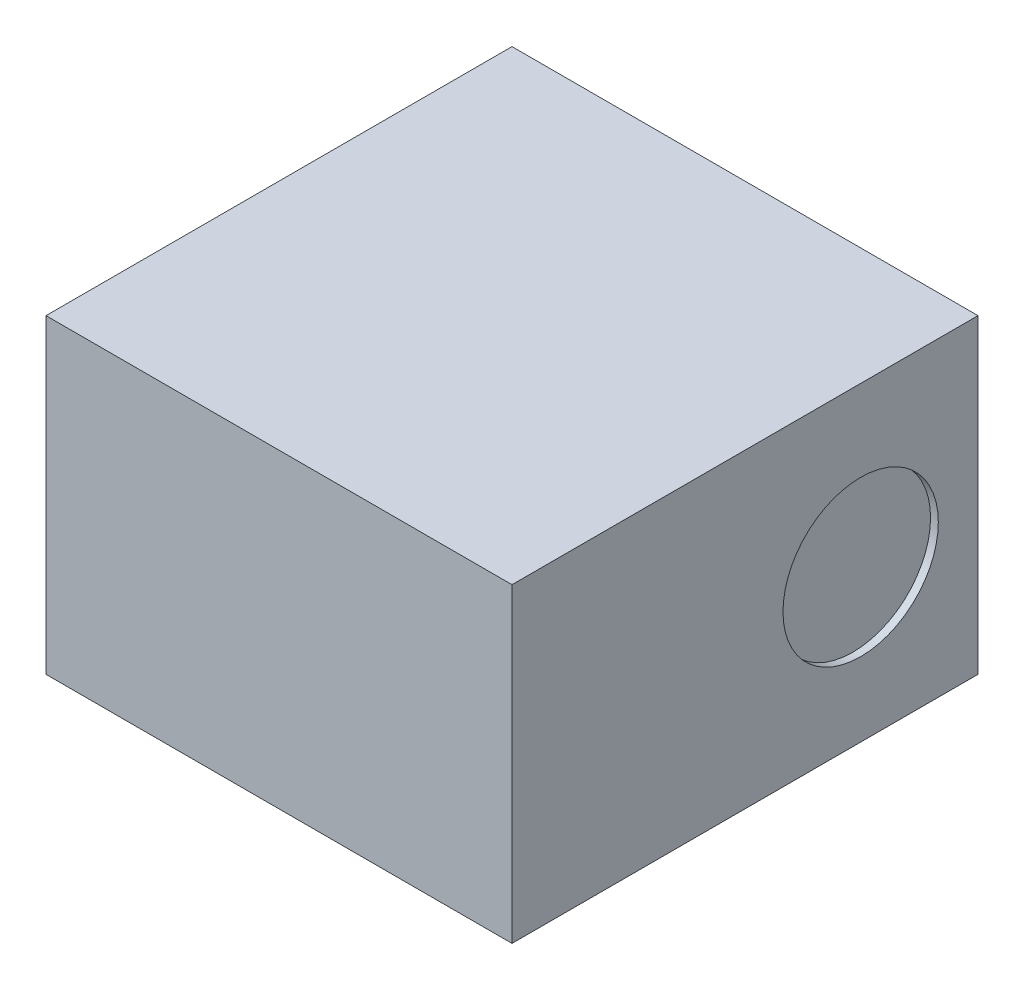
ISO-10303-21;
HEADER;
FILE_DESCRIPTION(('STEP AP214'),'2;1');
FILE_NAME('part.step','',(''),(''),'','','');
FILE_SCHEMA(('AUTOMOTIVE_DESIGN { 1 0 10303 214 1 1 1 1 }'));
ENDSEC;
DATA;
#1=APPLICATION_CONTEXT('core data for automotive mechanical design processes');
#2=APPLICATION_PROTOCOL_DEFINITION('international standard','automotive_design',2000,#1);
#3=PRODUCT_CONTEXT('',#1,'mechanical');
#4=PRODUCT('Part','Part','',(#3));
#5=PRODUCT_RELATED_PRODUCT_CATEGORY('part','',(#4));
#6=PRODUCT_DEFINITION_FORMATION('','',#4);
#7=PRODUCT_DEFINITION_CONTEXT('part definition',#1,'design');
#8=PRODUCT_DEFINITION('design','',#6,#7);
#9=PRODUCT_DEFINITION_SHAPE('','',#8);
#10=(LENGTH_UNIT() NAMED_UNIT(*) SI_UNIT(.MILLI.,.METRE.));
#11=(NAMED_UNIT(*) PLANE_ANGLE_UNIT() SI_UNIT($,.RADIAN.));
#12=(NAMED_UNIT(*) SI_UNIT($,.STERADIAN.) SOLID_ANGLE_UNIT());
#13=UNCERTAINTY_MEASURE_WITH_UNIT(LENGTH_MEASURE(1.E-05),#10,'distance_accuracy_value','');
#14=(GEOMETRIC_REPRESENTATION_CONTEXT(3) GLOBAL_UNCERTAINTY_ASSIGNED_CONTEXT((#13)) GLOBAL_UNIT_ASSIGNED_CONTEXT((#10,
#11,#12)) REPRESENTATION_CONTEXT('',''));
#15=CARTESIAN_POINT('',(0.,0.,0.));
#16=DIRECTION('',(0.,0.,1.));
#17=DIRECTION('',(1.,0.,0.));
#18=AXIS2_PLACEMENT_3D('',#15,#16,#17);
#19=CARTESIAN_POINT('',(-1.5,2.,-1.5));
#20=DIRECTION('',(1.,0.,0.));
#21=DIRECTION('',(0.,0.,-1.));
#22=AXIS2_PLACEMENT_3D('',#19,#20,#21);
#23=PLANE('',#22);
#24=DIRECTION('',(0.,0.,1.));
#25=VECTOR('',#24,1.);
#26=CARTESIAN_POINT('',(-1.5,0.,-1.5));
#27=LINE('',#26,#25);
#28=CARTESIAN_POINT('',(-1.5,0.,-1.5));
#29=VERTEX_POINT('',#28);
#30=CARTESIAN_POINT('',(-1.5,0.,1.5));
#31=VERTEX_POINT('',#30);
#32=EDGE_CURVE('E109',#29,#31,#27,.T.);
#33=ORIENTED_EDGE('',*,*,#32,.T.);
#34=DIRECTION('',(0.,-1.,0.));
#35=VECTOR('',#34,1.);
#36=CARTESIAN_POINT('',(-1.5,2.,1.5));
#37=LINE('',#36,#35);
#38=CARTESIAN_POINT('',(-1.5,2.,1.5));
#39=VERTEX_POINT('',#38);
#40=EDGE_CURVE('E11',#39,#31,#37,.T.);
#41=ORIENTED_EDGE('',*,*,#40,.F.);
#42=DIRECTION('',(0.,0.,1.));
#43=VECTOR('',#42,1.);
#44=CARTESIAN_POINT('',(-1.5,2.,-1.5));
#45=LINE('',#44,#43);
#46=CARTESIAN_POINT('',(-1.5,2.,-1.5));
#47=VERTEX_POINT('',#46);
#48=EDGE_CURVE('E93',#47,#39,#45,.T.);
#49=ORIENTED_EDGE('',*,*,#48,.F.);
#50=DIRECTION('',(0.,-1.,0.));
#51=VECTOR('',#50,1.);
#52=CARTESIAN_POINT('',(-1.5,2.,-1.5));
#53=LINE('',#52,#51);
#54=EDGE_CURVE('E105',#47,#29,#53,.T.);
#55=ORIENTED_EDGE('',*,*,#54,.T.);
#56=EDGE_LOOP('',(#33,#41,#49,#55));
#57=FACE_BOUND('',#56,.T.);
#58=ADVANCED_FACE('F41',(#57),#23,.F.);
#59=CARTESIAN_POINT('',(-1.5,2.,1.5));
#60=DIRECTION('',(0.,0.,-1.));
#61=DIRECTION('',(-1.,0.,0.));
#62=AXIS2_PLACEMENT_3D('',#59,#60,#61);
#63=PLANE('',#62);
#64=DIRECTION('',(1.,0.,0.));
#65=VECTOR('',#64,1.);
#66=CARTESIAN_POINT('',(-1.5,0.,1.5));
#67=LINE('',#66,#65);
#68=CARTESIAN_POINT('',(1.5,0.,1.5));
#69=VERTEX_POINT('',#68);
#70=EDGE_CURVE('E98',#31,#69,#67,.T.);
#71=ORIENTED_EDGE('',*,*,#70,.T.);
#72=DIRECTION('',(0.,-1.,0.));
#73=VECTOR('',#72,1.);
#74=CARTESIAN_POINT('',(1.5,2.,1.5));
#75=LINE('',#74,#73);
#76=CARTESIAN_POINT('',(1.5,2.,1.5));
#77=VERTEX_POINT('',#76);
#78=EDGE_CURVE('E50',#77,#69,#75,.T.);
#79=ORIENTED_EDGE('',*,*,#78,.F.);
#80=DIRECTION('',(1.,0.,0.));
#81=VECTOR('',#80,1.);
#82=CARTESIAN_POINT('',(-1.5,2.,1.5));
#83=LINE('',#82,#81);
#84=EDGE_CURVE('E88',#39,#77,#83,.T.);
#85=ORIENTED_EDGE('',*,*,#84,.F.);
#86=ORIENTED_EDGE('',*,*,#40,.T.);
#87=EDGE_LOOP('',(#71,#79,#85,#86));
#88=FACE_BOUND('',#87,.T.);
#89=ADVANCED_FACE('F97',(#88),#63,.F.);
#90=CARTESIAN_POINT('',(1.5,2.,-1.5));
#91=DIRECTION('',(-1.,0.,0.));
#92=DIRECTION('',(0.,0.,1.));
#93=AXIS2_PLACEMENT_3D('',#90,#91,#92);
#94=PLANE('',#93);
#95=CARTESIAN_POINT('',(1.5,0.976289457581985,-0.744511031925999));
#96=DIRECTION('',(1.,0.,0.));
#97=DIRECTION('',(0.,0.,-1.));
#98=AXIS2_PLACEMENT_3D('',#95,#96,#97);
#99=CIRCLE('',#98,0.5);
#100=CARTESIAN_POINT('',(1.5,0.976289457581985,-1.244511031926));
#101=VERTEX_POINT('',#100);
#102=EDGE_CURVE('E131',#101,#101,#99,.T.);
#103=ORIENTED_EDGE('',*,*,#102,.F.);
#104=EDGE_LOOP('',(#103));
#105=FACE_BOUND('',#104,.T.);
#106=DIRECTION('',(0.,0.,-1.));
#107=VECTOR('',#106,1.);
#108=CARTESIAN_POINT('',(1.5,0.,-1.5));
#109=LINE('',#108,#107);
#110=CARTESIAN_POINT('',(1.5,0.,-1.5));
#111=VERTEX_POINT('',#110);
#112=EDGE_CURVE('E75',#69,#111,#109,.T.);
#113=ORIENTED_EDGE('',*,*,#112,.T.);
#114=DIRECTION('',(0.,-1.,0.));
#115=VECTOR('',#114,1.);
#116=CARTESIAN_POINT('',(1.5,2.,-1.5));
#117=LINE('',#116,#115);
#118=CARTESIAN_POINT('',(1.5,2.,-1.5));
#119=VERTEX_POINT('',#118);
#120=EDGE_CURVE('E100',#119,#111,#117,.T.);
#121=ORIENTED_EDGE('',*,*,#120,.F.);
#122=DIRECTION('',(0.,0.,-1.));
#123=VECTOR('',#122,1.);
#124=CARTESIAN_POINT('',(1.5,2.,-1.5));
#125=LINE('',#124,#123);
#126=EDGE_CURVE('E91',#77,#119,#125,.T.);
#127=ORIENTED_EDGE('',*,*,#126,.F.);
#128=ORIENTED_EDGE('',*,*,#78,.T.);
#129=EDGE_LOOP('',(#113,#121,#127,#128));
#130=FACE_BOUND('',#129,.T.);
#131=ADVANCED_FACE('F101',(#105,#130),#94,.F.);
#132=CARTESIAN_POINT('',(-1.5,2.,-1.5));
#133=DIRECTION('',(0.,0.,1.));
#134=DIRECTION('',(1.,0.,0.));
#135=AXIS2_PLACEMENT_3D('',#132,#133,#134);
#136=PLANE('',#135);
#137=DIRECTION('',(-1.,0.,0.));
#138=VECTOR('',#137,1.);
#139=CARTESIAN_POINT('',(-1.5,0.,-1.5));
#140=LINE('',#139,#138);
#141=EDGE_CURVE('E81',#111,#29,#140,.T.);
#142=ORIENTED_EDGE('',*,*,#141,.T.);
#143=ORIENTED_EDGE('',*,*,#54,.F.);
#144=DIRECTION('',(-1.,0.,0.));
#145=VECTOR('',#144,1.);
#146=CARTESIAN_POINT('',(-1.5,2.,-1.5));
#147=LINE('',#146,#145);
#148=EDGE_CURVE('E58',#119,#47,#147,.T.);
#149=ORIENTED_EDGE('',*,*,#148,.F.);
#150=ORIENTED_EDGE('',*,*,#120,.T.);
#151=EDGE_LOOP('',(#142,#143,#149,#150));
#152=FACE_BOUND('',#151,.T.);
#153=ADVANCED_FACE('F123',(#152),#136,.F.);
#154=CARTESIAN_POINT('',(0.,2.,0.));
#155=DIRECTION('',(0.,1.,0.));
#156=DIRECTION('',(0.,0.,1.));
#157=AXIS2_PLACEMENT_3D('',#154,#155,#156);
#158=PLANE('',#157);
#159=ORIENTED_EDGE('',*,*,#48,.T.);
#160=ORIENTED_EDGE('',*,*,#84,.T.);
#161=ORIENTED_EDGE('',*,*,#126,.T.);
#162=ORIENTED_EDGE('',*,*,#148,.T.);
#163=EDGE_LOOP('',(#159,#160,#161,#162));
#164=FACE_BOUND('',#163,.T.);
#165=ADVANCED_FACE('F89',(#164),#158,.T.);
#166=CARTESIAN_POINT('',(0.,0.,0.));
#167=DIRECTION('',(0.,1.,0.));
#168=DIRECTION('',(0.,0.,1.));
#169=AXIS2_PLACEMENT_3D('',#166,#167,#168);
#170=PLANE('',#169);
#171=ORIENTED_EDGE('',*,*,#32,.F.);
#172=ORIENTED_EDGE('',*,*,#141,.F.);
#173=ORIENTED_EDGE('',*,*,#112,.F.);
#174=ORIENTED_EDGE('',*,*,#70,.F.);
#175=EDGE_LOOP('',(#171,#172,#173,#174));
#176=FACE_BOUND('',#175,.T.);
#177=ADVANCED_FACE('F126',(#176),#170,.F.);
#178=CARTESIAN_POINT('',(1.45,0.976289457581985,-0.744511031925999));
#179=DIRECTION('',(1.,0.,0.));
#180=DIRECTION('',(0.,0.,-1.));
#181=AXIS2_PLACEMENT_3D('',#178,#179,#180);
#182=CYLINDRICAL_SURFACE('',#181,0.5);
#183=CARTESIAN_POINT('',(1.45,0.976289457581985,-0.744511031925999));
#184=DIRECTION('',(1.,0.,0.));
#185=DIRECTION('',(0.,0.,-1.));
#186=AXIS2_PLACEMENT_3D('',#183,#184,#185);
#187=CIRCLE('',#186,0.5);
#188=CARTESIAN_POINT('',(1.45,0.976289457581985,-1.244511031926));
#189=VERTEX_POINT('',#188);
#190=EDGE_CURVE('E113',#189,#189,#187,.T.);
#191=ORIENTED_EDGE('',*,*,#190,.F.);
#192=EDGE_LOOP('',(#191));
#193=FACE_BOUND('',#192,.T.);
#194=ORIENTED_EDGE('',*,*,#102,.T.);
#195=EDGE_LOOP('',(#194));
#196=FACE_BOUND('',#195,.T.);
#197=ADVANCED_FACE('F140',(#193,#196),#182,.F.);
#198=CARTESIAN_POINT('',(1.45,0.976289457581985,-0.744511031925999));
#199=DIRECTION('',(1.,0.,0.));
#200=DIRECTION('',(0.,0.,-1.));
#201=AXIS2_PLACEMENT_3D('',#198,#199,#200);
#202=PLANE('',#201);
#203=ORIENTED_EDGE('',*,*,#190,.T.);
#204=EDGE_LOOP('',(#203));
#205=FACE_BOUND('',#204,.T.);
#206=ADVANCED_FACE('F138',(#205),#202,.T.);
#207=CLOSED_SHELL('',(#58,#89,#131,#153,#165,#177,#197,#206));
#208=MANIFOLD_SOLID_BREP('B2',#207);
#209=ADVANCED_BREP_SHAPE_REPRESENTATION('',(#18,#208),#14);
#210=SHAPE_DEFINITION_REPRESENTATION(#9,#209);
ENDSEC;
END-ISO-10303-21;
